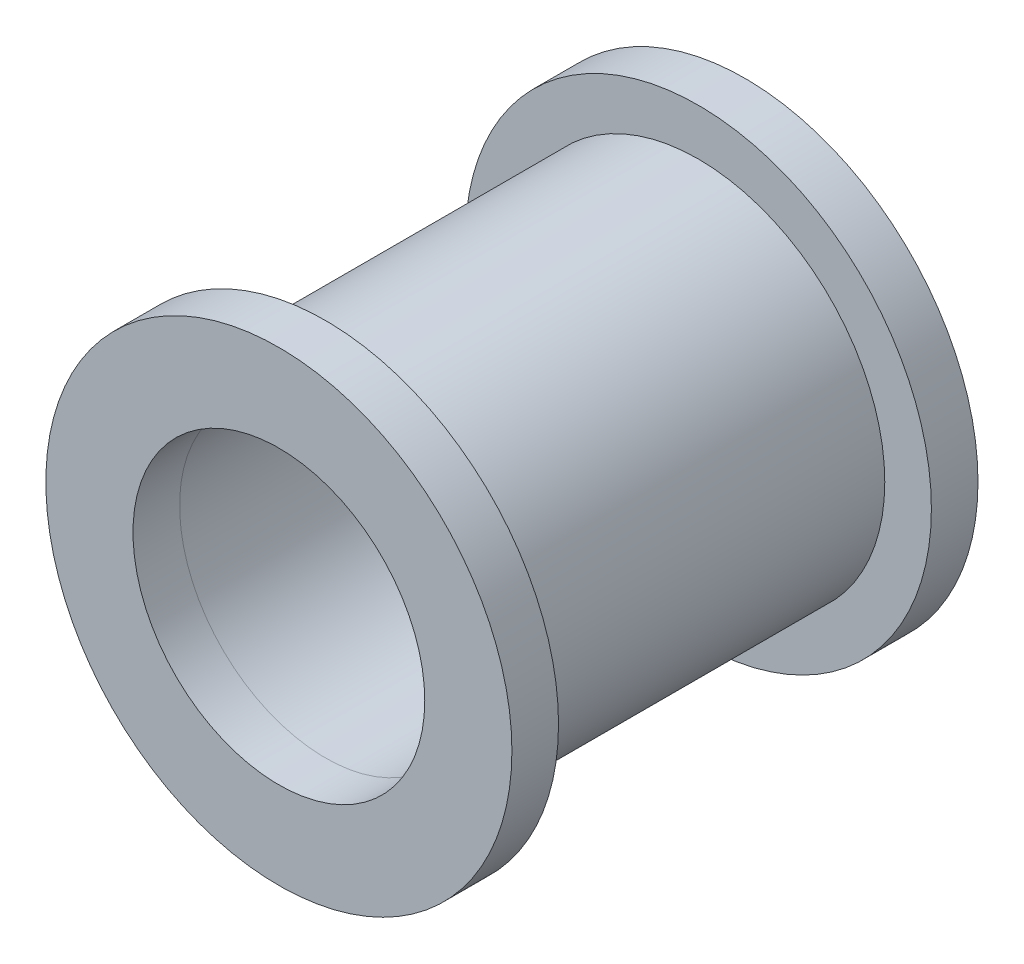
ISO-10303-21;
HEADER;
FILE_DESCRIPTION(('STEP AP214'),'2;1');
FILE_NAME('part.step','',(''),(''),'','','');
FILE_SCHEMA(('AUTOMOTIVE_DESIGN { 1 0 10303 214 1 1 1 1 }'));
ENDSEC;
DATA;
#1=APPLICATION_CONTEXT('core data for automotive mechanical design processes');
#2=APPLICATION_PROTOCOL_DEFINITION('international standard','automotive_design',2000,#1);
#3=PRODUCT_CONTEXT('',#1,'mechanical');
#4=PRODUCT('Part','Part','',(#3));
#5=PRODUCT_RELATED_PRODUCT_CATEGORY('part','',(#4));
#6=PRODUCT_DEFINITION_FORMATION('','',#4);
#7=PRODUCT_DEFINITION_CONTEXT('part definition',#1,'design');
#8=PRODUCT_DEFINITION('design','',#6,#7);
#9=PRODUCT_DEFINITION_SHAPE('','',#8);
#10=(LENGTH_UNIT() NAMED_UNIT(*) SI_UNIT(.MILLI.,.METRE.));
#11=(NAMED_UNIT(*) PLANE_ANGLE_UNIT() SI_UNIT($,.RADIAN.));
#12=(NAMED_UNIT(*) SI_UNIT($,.STERADIAN.) SOLID_ANGLE_UNIT());
#13=UNCERTAINTY_MEASURE_WITH_UNIT(LENGTH_MEASURE(1.E-05),#10,'distance_accuracy_value','');
#14=(GEOMETRIC_REPRESENTATION_CONTEXT(3) GLOBAL_UNCERTAINTY_ASSIGNED_CONTEXT((#13)) GLOBAL_UNIT_ASSIGNED_CONTEXT((#10,
#11,#12)) REPRESENTATION_CONTEXT('',''));
#15=CARTESIAN_POINT('',(0.,0.,0.));
#16=DIRECTION('',(0.,0.,1.));
#17=DIRECTION('',(1.,0.,0.));
#18=AXIS2_PLACEMENT_3D('',#15,#16,#17);
#19=CARTESIAN_POINT('',(0.,0.,1.27));
#20=DIRECTION('',(0.,0.,1.));
#21=DIRECTION('',(1.,0.,0.));
#22=AXIS2_PLACEMENT_3D('',#19,#20,#21);
#23=PLANE('',#22);
#24=CARTESIAN_POINT('',(0.,0.,1.27));
#25=DIRECTION('',(0.,0.,1.));
#26=DIRECTION('',(1.,0.,0.));
#27=AXIS2_PLACEMENT_3D('',#24,#25,#26);
#28=CIRCLE('',#27,6.35);
#29=CARTESIAN_POINT('',(6.35,0.,1.27));
#30=VERTEX_POINT('',#29);
#31=EDGE_CURVE('E11',#30,#30,#28,.T.);
#32=ORIENTED_EDGE('',*,*,#31,.T.);
#33=EDGE_LOOP('',(#32));
#34=FACE_BOUND('',#33,.T.);
#35=CARTESIAN_POINT('',(0.,0.,1.27));
#36=DIRECTION('',(0.,0.,1.));
#37=DIRECTION('',(1.,0.,0.));
#38=AXIS2_PLACEMENT_3D('',#35,#36,#37);
#39=CIRCLE('',#38,3.9751);
#40=CARTESIAN_POINT('',(3.9751,0.,1.27));
#41=VERTEX_POINT('',#40);
#42=EDGE_CURVE('E53',#41,#41,#39,.T.);
#43=ORIENTED_EDGE('',*,*,#42,.F.);
#44=EDGE_LOOP('',(#43));
#45=FACE_BOUND('',#44,.T.);
#46=ADVANCED_FACE('F42',(#34,#45),#23,.T.);
#47=CARTESIAN_POINT('',(0.,0.,0.));
#48=DIRECTION('',(0.,0.,1.));
#49=DIRECTION('',(1.,0.,0.));
#50=AXIS2_PLACEMENT_3D('',#47,#48,#49);
#51=PLANE('',#50);
#52=CARTESIAN_POINT('',(0.,0.,0.));
#53=DIRECTION('',(0.,0.,1.));
#54=DIRECTION('',(1.,0.,0.));
#55=AXIS2_PLACEMENT_3D('',#52,#53,#54);
#56=CIRCLE('',#55,6.35);
#57=CARTESIAN_POINT('',(6.35,0.,0.));
#58=VERTEX_POINT('',#57);
#59=EDGE_CURVE('E46',#58,#58,#56,.T.);
#60=ORIENTED_EDGE('',*,*,#59,.F.);
#61=EDGE_LOOP('',(#60));
#62=FACE_BOUND('',#61,.T.);
#63=CARTESIAN_POINT('',(0.,0.,0.));
#64=DIRECTION('',(0.,0.,1.));
#65=DIRECTION('',(1.,0.,0.));
#66=AXIS2_PLACEMENT_3D('',#63,#64,#65);
#67=CIRCLE('',#66,3.9751);
#68=CARTESIAN_POINT('',(3.9751,0.,0.));
#69=VERTEX_POINT('',#68);
#70=EDGE_CURVE('E55',#69,#69,#67,.T.);
#71=ORIENTED_EDGE('',*,*,#70,.T.);
#72=EDGE_LOOP('',(#71));
#73=FACE_BOUND('',#72,.T.);
#74=ADVANCED_FACE('F65',(#62,#73),#51,.F.);
#75=CARTESIAN_POINT('',(0.,0.,1.27));
#76=DIRECTION('',(0.,0.,-1.));
#77=DIRECTION('',(-1.,0.,0.));
#78=AXIS2_PLACEMENT_3D('',#75,#76,#77);
#79=CYLINDRICAL_SURFACE('',#78,6.35);
#80=ORIENTED_EDGE('',*,*,#31,.F.);
#81=EDGE_LOOP('',(#80));
#82=FACE_BOUND('',#81,.T.);
#83=ORIENTED_EDGE('',*,*,#59,.T.);
#84=EDGE_LOOP('',(#83));
#85=FACE_BOUND('',#84,.T.);
#86=ADVANCED_FACE('F44',(#82,#85),#79,.T.);
#87=CARTESIAN_POINT('',(0.,0.,1.27));
#88=DIRECTION('',(0.,0.,-1.));
#89=DIRECTION('',(-1.,0.,0.));
#90=AXIS2_PLACEMENT_3D('',#87,#88,#89);
#91=CYLINDRICAL_SURFACE('',#90,3.9751);
#92=ORIENTED_EDGE('',*,*,#42,.T.);
#93=EDGE_LOOP('',(#92));
#94=FACE_BOUND('',#93,.T.);
#95=ORIENTED_EDGE('',*,*,#70,.F.);
#96=EDGE_LOOP('',(#95));
#97=FACE_BOUND('',#96,.T.);
#98=ADVANCED_FACE('F61',(#94,#97),#91,.F.);
#99=CLOSED_SHELL('',(#46,#74,#86,#98));
#100=MANIFOLD_SOLID_BREP('B2',#99);
#101=CARTESIAN_POINT('',(0.,0.,-5.08));
#102=DIRECTION('',(0.,0.,1.));
#103=DIRECTION('',(1.,0.,0.));
#104=AXIS2_PLACEMENT_3D('',#101,#102,#103);
#105=CYLINDRICAL_SURFACE('',#104,5.08);
#106=CARTESIAN_POINT('',(0.,0.,0.));
#107=DIRECTION('',(0.,0.,1.));
#108=DIRECTION('',(1.,0.,0.));
#109=AXIS2_PLACEMENT_3D('',#106,#107,#108);
#110=CIRCLE('',#109,5.08);
#111=CARTESIAN_POINT('',(5.08,0.,0.));
#112=VERTEX_POINT('',#111);
#113=EDGE_CURVE('E41',#112,#112,#110,.T.);
#114=ORIENTED_EDGE('',*,*,#113,.F.);
#115=EDGE_LOOP('',(#114));
#116=FACE_BOUND('',#115,.T.);
#117=CARTESIAN_POINT('',(0.,0.,-10.16));
#118=DIRECTION('',(0.,0.,1.));
#119=DIRECTION('',(1.,0.,0.));
#120=AXIS2_PLACEMENT_3D('',#117,#118,#119);
#121=CIRCLE('',#120,5.08);
#122=CARTESIAN_POINT('',(5.08,0.,-10.16));
#123=VERTEX_POINT('',#122);
#124=EDGE_CURVE('E113',#123,#123,#121,.T.);
#125=ORIENTED_EDGE('',*,*,#124,.T.);
#126=EDGE_LOOP('',(#125));
#127=FACE_BOUND('',#126,.T.);
#128=ADVANCED_FACE('F103',(#116,#127),#105,.T.);
#129=CARTESIAN_POINT('',(0.,0.,0.));
#130=DIRECTION('',(0.,0.,1.));
#131=DIRECTION('',(1.,0.,0.));
#132=AXIS2_PLACEMENT_3D('',#129,#130,#131);
#133=PLANE('',#132);
#134=CARTESIAN_POINT('',(0.,0.,0.));
#135=DIRECTION('',(0.,0.,1.));
#136=DIRECTION('',(1.,0.,0.));
#137=AXIS2_PLACEMENT_3D('',#134,#135,#136);
#138=CIRCLE('',#137,3.9751);
#139=CARTESIAN_POINT('',(3.9751,0.,0.));
#140=VERTEX_POINT('',#139);
#141=EDGE_CURVE('E109',#140,#140,#138,.T.);
#142=ORIENTED_EDGE('',*,*,#141,.F.);
#143=EDGE_LOOP('',(#142));
#144=FACE_BOUND('',#143,.T.);
#145=ORIENTED_EDGE('',*,*,#113,.T.);
#146=EDGE_LOOP('',(#145));
#147=FACE_BOUND('',#146,.T.);
#148=ADVANCED_FACE('F133',(#144,#147),#133,.T.);
#149=CARTESIAN_POINT('',(0.,0.,-5.08));
#150=DIRECTION('',(0.,0.,1.));
#151=DIRECTION('',(1.,0.,0.));
#152=AXIS2_PLACEMENT_3D('',#149,#150,#151);
#153=CYLINDRICAL_SURFACE('',#152,3.9751);
#154=ORIENTED_EDGE('',*,*,#141,.T.);
#155=EDGE_LOOP('',(#154));
#156=FACE_BOUND('',#155,.T.);
#157=CARTESIAN_POINT('',(0.,0.,-11.43));
#158=DIRECTION('',(0.,0.,1.));
#159=DIRECTION('',(1.,0.,0.));
#160=AXIS2_PLACEMENT_3D('',#157,#158,#159);
#161=CIRCLE('',#160,3.9751);
#162=CARTESIAN_POINT('',(3.9751,0.,-11.43));
#163=VERTEX_POINT('',#162);
#164=EDGE_CURVE('E123',#163,#163,#161,.T.);
#165=ORIENTED_EDGE('',*,*,#164,.F.);
#166=EDGE_LOOP('',(#165));
#167=FACE_BOUND('',#166,.T.);
#168=ADVANCED_FACE('F131',(#156,#167),#153,.F.);
#169=CARTESIAN_POINT('',(0.,0.,-11.43));
#170=DIRECTION('',(0.,0.,-1.));
#171=DIRECTION('',(1.,0.,0.));
#172=AXIS2_PLACEMENT_3D('',#169,#170,#171);
#173=PLANE('',#172);
#174=CARTESIAN_POINT('',(0.,0.,-11.43));
#175=DIRECTION('',(0.,0.,1.));
#176=DIRECTION('',(1.,0.,0.));
#177=AXIS2_PLACEMENT_3D('',#174,#175,#176);
#178=CIRCLE('',#177,6.35);
#179=CARTESIAN_POINT('',(6.35,0.,-11.43));
#180=VERTEX_POINT('',#179);
#181=EDGE_CURVE('E117',#180,#180,#178,.T.);
#182=ORIENTED_EDGE('',*,*,#181,.F.);
#183=EDGE_LOOP('',(#182));
#184=FACE_BOUND('',#183,.T.);
#185=ORIENTED_EDGE('',*,*,#164,.T.);
#186=EDGE_LOOP('',(#185));
#187=FACE_BOUND('',#186,.T.);
#188=ADVANCED_FACE('F129',(#184,#187),#173,.T.);
#189=CARTESIAN_POINT('',(0.,0.,-10.16));
#190=DIRECTION('',(0.,0.,-1.));
#191=DIRECTION('',(1.,0.,0.));
#192=AXIS2_PLACEMENT_3D('',#189,#190,#191);
#193=PLANE('',#192);
#194=ORIENTED_EDGE('',*,*,#124,.F.);
#195=EDGE_LOOP('',(#194));
#196=FACE_BOUND('',#195,.T.);
#197=CARTESIAN_POINT('',(0.,0.,-10.16));
#198=DIRECTION('',(0.,0.,1.));
#199=DIRECTION('',(1.,0.,0.));
#200=AXIS2_PLACEMENT_3D('',#197,#198,#199);
#201=CIRCLE('',#200,6.35);
#202=CARTESIAN_POINT('',(6.35,0.,-10.16));
#203=VERTEX_POINT('',#202);
#204=EDGE_CURVE('E120',#203,#203,#201,.T.);
#205=ORIENTED_EDGE('',*,*,#204,.T.);
#206=EDGE_LOOP('',(#205));
#207=FACE_BOUND('',#206,.T.);
#208=ADVANCED_FACE('F139',(#196,#207),#193,.F.);
#209=CARTESIAN_POINT('',(0.,0.,-11.43));
#210=DIRECTION('',(0.,0.,1.));
#211=DIRECTION('',(-1.,0.,0.));
#212=AXIS2_PLACEMENT_3D('',#209,#210,#211);
#213=CYLINDRICAL_SURFACE('',#212,6.35);
#214=ORIENTED_EDGE('',*,*,#181,.T.);
#215=EDGE_LOOP('',(#214));
#216=FACE_BOUND('',#215,.T.);
#217=ORIENTED_EDGE('',*,*,#204,.F.);
#218=EDGE_LOOP('',(#217));
#219=FACE_BOUND('',#218,.T.);
#220=ADVANCED_FACE('F153',(#216,#219),#213,.T.);
#221=CLOSED_SHELL('',(#128,#148,#168,#188,#208,#220));
#222=MANIFOLD_SOLID_BREP('B6',#221);
#223=ADVANCED_BREP_SHAPE_REPRESENTATION('',(#18,#100,#222),#14);
#224=SHAPE_DEFINITION_REPRESENTATION(#9,#223);
ENDSEC;
END-ISO-10303-21;
